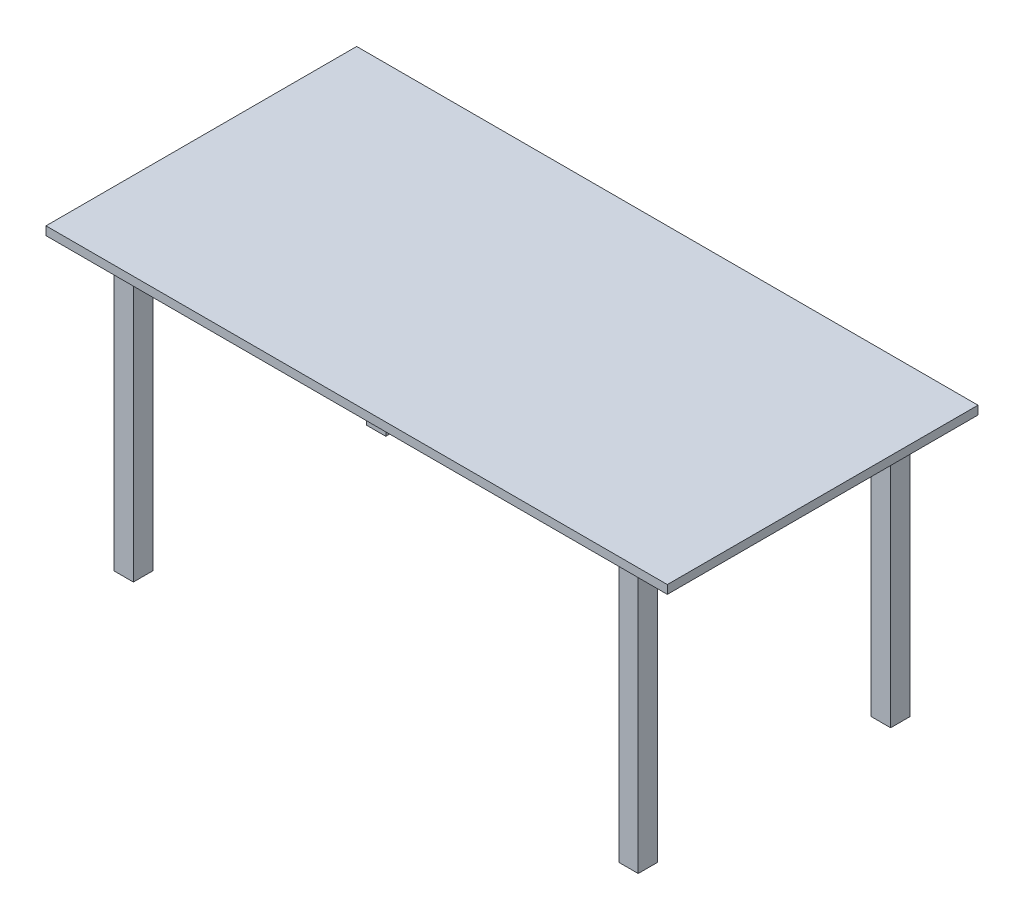
ISO-10303-21;
HEADER;
FILE_DESCRIPTION(('STEP AP214'),'2;1');
FILE_NAME('part.step','',(''),(''),'','','');
FILE_SCHEMA(('AUTOMOTIVE_DESIGN { 1 0 10303 214 1 1 1 1 }'));
ENDSEC;
DATA;
#1=APPLICATION_CONTEXT('core data for automotive mechanical design processes');
#2=APPLICATION_PROTOCOL_DEFINITION('international standard','automotive_design',2000,#1);
#3=PRODUCT_CONTEXT('',#1,'mechanical');
#4=PRODUCT('Part','Part','',(#3));
#5=PRODUCT_RELATED_PRODUCT_CATEGORY('part','',(#4));
#6=PRODUCT_DEFINITION_FORMATION('','',#4);
#7=PRODUCT_DEFINITION_CONTEXT('part definition',#1,'design');
#8=PRODUCT_DEFINITION('design','',#6,#7);
#9=PRODUCT_DEFINITION_SHAPE('','',#8);
#10=(LENGTH_UNIT() NAMED_UNIT(*) SI_UNIT(.MILLI.,.METRE.));
#11=(NAMED_UNIT(*) PLANE_ANGLE_UNIT() SI_UNIT($,.RADIAN.));
#12=(NAMED_UNIT(*) SI_UNIT($,.STERADIAN.) SOLID_ANGLE_UNIT());
#13=UNCERTAINTY_MEASURE_WITH_UNIT(LENGTH_MEASURE(1.E-05),#10,'distance_accuracy_value','');
#14=(GEOMETRIC_REPRESENTATION_CONTEXT(3) GLOBAL_UNCERTAINTY_ASSIGNED_CONTEXT((#13)) GLOBAL_UNIT_ASSIGNED_CONTEXT((#10,
#11,#12)) REPRESENTATION_CONTEXT('',''));
#15=CARTESIAN_POINT('',(0.,0.,0.));
#16=DIRECTION('',(0.,0.,1.));
#17=DIRECTION('',(1.,0.,0.));
#18=AXIS2_PLACEMENT_3D('',#15,#16,#17);
#19=CARTESIAN_POINT('',(0.,0.,0.));
#20=DIRECTION('',(0.,1.,0.));
#21=DIRECTION('',(0.,0.,1.));
#22=AXIS2_PLACEMENT_3D('',#19,#20,#21);
#23=PLANE('',#22);
#24=DIRECTION('',(1.,0.,0.));
#25=VECTOR('',#24,1.);
#26=CARTESIAN_POINT('',(-675.,0.,-350.));
#27=LINE('',#26,#25);
#28=CARTESIAN_POINT('',(-675.,0.,-350.));
#29=VERTEX_POINT('',#28);
#30=CARTESIAN_POINT('',(-625.,0.,-350.));
#31=VERTEX_POINT('',#30);
#32=EDGE_CURVE('E192',#29,#31,#27,.T.);
#33=ORIENTED_EDGE('',*,*,#32,.F.);
#34=DIRECTION('',(0.,0.,-1.));
#35=VECTOR('',#34,1.);
#36=CARTESIAN_POINT('',(-675.,0.,-350.));
#37=LINE('',#36,#35);
#38=CARTESIAN_POINT('',(-675.,0.,-300.));
#39=VERTEX_POINT('',#38);
#40=EDGE_CURVE('E205',#39,#29,#37,.T.);
#41=ORIENTED_EDGE('',*,*,#40,.F.);
#42=DIRECTION('',(-1.,0.,0.));
#43=VECTOR('',#42,1.);
#44=CARTESIAN_POINT('',(-675.,0.,-300.));
#45=LINE('',#44,#43);
#46=CARTESIAN_POINT('',(-625.,0.,-300.));
#47=VERTEX_POINT('',#46);
#48=EDGE_CURVE('E214',#47,#39,#45,.T.);
#49=ORIENTED_EDGE('',*,*,#48,.F.);
#50=DIRECTION('',(0.,0.,1.));
#51=VECTOR('',#50,1.);
#52=CARTESIAN_POINT('',(-625.,0.,-350.));
#53=LINE('',#52,#51);
#54=EDGE_CURVE('E195',#31,#47,#53,.T.);
#55=ORIENTED_EDGE('',*,*,#54,.F.);
#56=EDGE_LOOP('',(#33,#41,#49,#55));
#57=FACE_BOUND('',#56,.T.);
#58=DIRECTION('',(0.,0.,1.));
#59=VECTOR('',#58,1.);
#60=CARTESIAN_POINT('',(-625.,0.,350.));
#61=LINE('',#60,#59);
#62=CARTESIAN_POINT('',(-625.,0.,300.));
#63=VERTEX_POINT('',#62);
#64=CARTESIAN_POINT('',(-625.,0.,350.));
#65=VERTEX_POINT('',#64);
#66=EDGE_CURVE('E263',#63,#65,#61,.T.);
#67=ORIENTED_EDGE('',*,*,#66,.F.);
#68=DIRECTION('',(1.,0.,0.));
#69=VECTOR('',#68,1.);
#70=CARTESIAN_POINT('',(-675.,0.,300.));
#71=LINE('',#70,#69);
#72=CARTESIAN_POINT('',(-675.,0.,300.));
#73=VERTEX_POINT('',#72);
#74=EDGE_CURVE('E268',#73,#63,#71,.T.);
#75=ORIENTED_EDGE('',*,*,#74,.F.);
#76=DIRECTION('',(0.,0.,-1.));
#77=VECTOR('',#76,1.);
#78=CARTESIAN_POINT('',(-675.,0.,350.));
#79=LINE('',#78,#77);
#80=CARTESIAN_POINT('',(-675.,0.,350.));
#81=VERTEX_POINT('',#80);
#82=EDGE_CURVE('E280',#81,#73,#79,.T.);
#83=ORIENTED_EDGE('',*,*,#82,.F.);
#84=DIRECTION('',(-1.,0.,0.));
#85=VECTOR('',#84,1.);
#86=CARTESIAN_POINT('',(-675.,0.,350.));
#87=LINE('',#86,#85);
#88=EDGE_CURVE('E277',#65,#81,#87,.T.);
#89=ORIENTED_EDGE('',*,*,#88,.F.);
#90=EDGE_LOOP('',(#67,#75,#83,#89));
#91=FACE_BOUND('',#90,.T.);
#92=DIRECTION('',(0.,0.,-1.));
#93=VECTOR('',#92,1.);
#94=CARTESIAN_POINT('',(800.,0.,-400.));
#95=LINE('',#94,#93);
#96=CARTESIAN_POINT('',(800.,0.,400.));
#97=VERTEX_POINT('',#96);
#98=CARTESIAN_POINT('',(800.,0.,-400.));
#99=VERTEX_POINT('',#98);
#100=EDGE_CURVE('E296',#97,#99,#95,.T.);
#101=ORIENTED_EDGE('',*,*,#100,.F.);
#102=DIRECTION('',(1.,0.,0.));
#103=VECTOR('',#102,1.);
#104=CARTESIAN_POINT('',(-800.,0.,400.));
#105=LINE('',#104,#103);
#106=CARTESIAN_POINT('',(-800.,0.,400.));
#107=VERTEX_POINT('',#106);
#108=EDGE_CURVE('E301',#107,#97,#105,.T.);
#109=ORIENTED_EDGE('',*,*,#108,.F.);
#110=DIRECTION('',(0.,0.,1.));
#111=VECTOR('',#110,1.);
#112=CARTESIAN_POINT('',(-800.,0.,-400.));
#113=LINE('',#112,#111);
#114=CARTESIAN_POINT('',(-800.,0.,-400.));
#115=VERTEX_POINT('',#114);
#116=EDGE_CURVE('E312',#115,#107,#113,.T.);
#117=ORIENTED_EDGE('',*,*,#116,.F.);
#118=DIRECTION('',(-1.,0.,0.));
#119=VECTOR('',#118,1.);
#120=CARTESIAN_POINT('',(-800.,0.,-400.));
#121=LINE('',#120,#119);
#122=EDGE_CURVE('E310',#99,#115,#121,.T.);
#123=ORIENTED_EDGE('',*,*,#122,.F.);
#124=EDGE_LOOP('',(#101,#109,#117,#123));
#125=FACE_BOUND('',#124,.T.);
#126=DIRECTION('',(0.,0.,1.));
#127=VECTOR('',#126,1.);
#128=CARTESIAN_POINT('',(675.,0.,350.));
#129=LINE('',#128,#127);
#130=CARTESIAN_POINT('',(675.,0.,300.));
#131=VERTEX_POINT('',#130);
#132=CARTESIAN_POINT('',(675.,0.,350.));
#133=VERTEX_POINT('',#132);
#134=EDGE_CURVE('E230',#131,#133,#129,.T.);
#135=ORIENTED_EDGE('',*,*,#134,.F.);
#136=DIRECTION('',(1.,0.,0.));
#137=VECTOR('',#136,1.);
#138=CARTESIAN_POINT('',(675.,0.,300.));
#139=LINE('',#138,#137);
#140=CARTESIAN_POINT('',(625.,0.,300.));
#141=VERTEX_POINT('',#140);
#142=EDGE_CURVE('E235',#141,#131,#139,.T.);
#143=ORIENTED_EDGE('',*,*,#142,.F.);
#144=DIRECTION('',(0.,0.,-1.));
#145=VECTOR('',#144,1.);
#146=CARTESIAN_POINT('',(625.,0.,350.));
#147=LINE('',#146,#145);
#148=CARTESIAN_POINT('',(625.,0.,350.));
#149=VERTEX_POINT('',#148);
#150=EDGE_CURVE('E247',#149,#141,#147,.T.);
#151=ORIENTED_EDGE('',*,*,#150,.F.);
#152=DIRECTION('',(-1.,0.,0.));
#153=VECTOR('',#152,1.);
#154=CARTESIAN_POINT('',(675.,0.,350.));
#155=LINE('',#154,#153);
#156=EDGE_CURVE('E244',#133,#149,#155,.T.);
#157=ORIENTED_EDGE('',*,*,#156,.F.);
#158=EDGE_LOOP('',(#135,#143,#151,#157));
#159=FACE_BOUND('',#158,.T.);
#160=DIRECTION('',(1.,0.,0.));
#161=VECTOR('',#160,1.);
#162=CARTESIAN_POINT('',(675.,0.,-350.));
#163=LINE('',#162,#161);
#164=CARTESIAN_POINT('',(625.,0.,-350.));
#165=VERTEX_POINT('',#164);
#166=CARTESIAN_POINT('',(675.,0.,-350.));
#167=VERTEX_POINT('',#166);
#168=EDGE_CURVE('E191',#165,#167,#163,.T.);
#169=ORIENTED_EDGE('',*,*,#168,.F.);
#170=DIRECTION('',(0.,0.,-1.));
#171=VECTOR('',#170,1.);
#172=CARTESIAN_POINT('',(625.,0.,-350.));
#173=LINE('',#172,#171);
#174=CARTESIAN_POINT('',(625.,0.,-300.));
#175=VERTEX_POINT('',#174);
#176=EDGE_CURVE('E188',#175,#165,#173,.T.);
#177=ORIENTED_EDGE('',*,*,#176,.F.);
#178=DIRECTION('',(-1.,0.,0.));
#179=VECTOR('',#178,1.);
#180=CARTESIAN_POINT('',(675.,0.,-300.));
#181=LINE('',#180,#179);
#182=CARTESIAN_POINT('',(675.,0.,-300.));
#183=VERTEX_POINT('',#182);
#184=EDGE_CURVE('E54',#183,#175,#181,.T.);
#185=ORIENTED_EDGE('',*,*,#184,.F.);
#186=DIRECTION('',(0.,0.,1.));
#187=VECTOR('',#186,1.);
#188=CARTESIAN_POINT('',(675.,0.,-350.));
#189=LINE('',#188,#187);
#190=EDGE_CURVE('E49',#167,#183,#189,.T.);
#191=ORIENTED_EDGE('',*,*,#190,.F.);
#192=EDGE_LOOP('',(#169,#177,#185,#191));
#193=FACE_BOUND('',#192,.T.);
#194=ADVANCED_FACE('F34',(#57,#91,#125,#159,#193),#23,.F.);
#195=CARTESIAN_POINT('',(800.,22.,-400.));
#196=DIRECTION('',(-1.,0.,0.));
#197=DIRECTION('',(0.,0.,1.));
#198=AXIS2_PLACEMENT_3D('',#195,#196,#197);
#199=PLANE('',#198);
#200=ORIENTED_EDGE('',*,*,#100,.T.);
#201=DIRECTION('',(0.,-1.,0.));
#202=VECTOR('',#201,1.);
#203=CARTESIAN_POINT('',(800.,22.,-400.));
#204=LINE('',#203,#202);
#205=CARTESIAN_POINT('',(800.,22.,-400.));
#206=VERTEX_POINT('',#205);
#207=EDGE_CURVE('E11',#206,#99,#204,.T.);
#208=ORIENTED_EDGE('',*,*,#207,.F.);
#209=DIRECTION('',(0.,0.,-1.));
#210=VECTOR('',#209,1.);
#211=CARTESIAN_POINT('',(800.,22.,-400.));
#212=LINE('',#211,#210);
#213=CARTESIAN_POINT('',(800.,22.,400.));
#214=VERTEX_POINT('',#213);
#215=EDGE_CURVE('E297',#214,#206,#212,.T.);
#216=ORIENTED_EDGE('',*,*,#215,.F.);
#217=DIRECTION('',(0.,-1.,0.));
#218=VECTOR('',#217,1.);
#219=CARTESIAN_POINT('',(800.,22.,400.));
#220=LINE('',#219,#218);
#221=EDGE_CURVE('E307',#214,#97,#220,.T.);
#222=ORIENTED_EDGE('',*,*,#221,.T.);
#223=EDGE_LOOP('',(#200,#208,#216,#222));
#224=FACE_BOUND('',#223,.T.);
#225=ADVANCED_FACE('F36',(#224),#199,.F.);
#226=CARTESIAN_POINT('',(-800.,22.,-400.));
#227=DIRECTION('',(0.,0.,1.));
#228=DIRECTION('',(1.,0.,0.));
#229=AXIS2_PLACEMENT_3D('',#226,#227,#228);
#230=PLANE('',#229);
#231=ORIENTED_EDGE('',*,*,#122,.T.);
#232=DIRECTION('',(0.,-1.,0.));
#233=VECTOR('',#232,1.);
#234=CARTESIAN_POINT('',(-800.,22.,-400.));
#235=LINE('',#234,#233);
#236=CARTESIAN_POINT('',(-800.,22.,-400.));
#237=VERTEX_POINT('',#236);
#238=EDGE_CURVE('E42',#237,#115,#235,.T.);
#239=ORIENTED_EDGE('',*,*,#238,.F.);
#240=DIRECTION('',(-1.,0.,0.));
#241=VECTOR('',#240,1.);
#242=CARTESIAN_POINT('',(-800.,22.,-400.));
#243=LINE('',#242,#241);
#244=EDGE_CURVE('E300',#206,#237,#243,.T.);
#245=ORIENTED_EDGE('',*,*,#244,.F.);
#246=ORIENTED_EDGE('',*,*,#207,.T.);
#247=EDGE_LOOP('',(#231,#239,#245,#246));
#248=FACE_BOUND('',#247,.T.);
#249=ADVANCED_FACE('F340',(#248),#230,.F.);
#250=CARTESIAN_POINT('',(-800.,22.,-400.));
#251=DIRECTION('',(1.,0.,0.));
#252=DIRECTION('',(0.,0.,-1.));
#253=AXIS2_PLACEMENT_3D('',#250,#251,#252);
#254=PLANE('',#253);
#255=ORIENTED_EDGE('',*,*,#116,.T.);
#256=DIRECTION('',(0.,-1.,0.));
#257=VECTOR('',#256,1.);
#258=CARTESIAN_POINT('',(-800.,22.,400.));
#259=LINE('',#258,#257);
#260=CARTESIAN_POINT('',(-800.,22.,400.));
#261=VERTEX_POINT('',#260);
#262=EDGE_CURVE('E317',#261,#107,#259,.T.);
#263=ORIENTED_EDGE('',*,*,#262,.F.);
#264=DIRECTION('',(0.,0.,1.));
#265=VECTOR('',#264,1.);
#266=CARTESIAN_POINT('',(-800.,22.,-400.));
#267=LINE('',#266,#265);
#268=EDGE_CURVE('E303',#237,#261,#267,.T.);
#269=ORIENTED_EDGE('',*,*,#268,.F.);
#270=ORIENTED_EDGE('',*,*,#238,.T.);
#271=EDGE_LOOP('',(#255,#263,#269,#270));
#272=FACE_BOUND('',#271,.T.);
#273=ADVANCED_FACE('F324',(#272),#254,.F.);
#274=CARTESIAN_POINT('',(-800.,22.,400.));
#275=DIRECTION('',(0.,0.,-1.));
#276=DIRECTION('',(-1.,0.,0.));
#277=AXIS2_PLACEMENT_3D('',#274,#275,#276);
#278=PLANE('',#277);
#279=ORIENTED_EDGE('',*,*,#108,.T.);
#280=ORIENTED_EDGE('',*,*,#221,.F.);
#281=DIRECTION('',(1.,0.,0.));
#282=VECTOR('',#281,1.);
#283=CARTESIAN_POINT('',(-800.,22.,400.));
#284=LINE('',#283,#282);
#285=EDGE_CURVE('E305',#261,#214,#284,.T.);
#286=ORIENTED_EDGE('',*,*,#285,.F.);
#287=ORIENTED_EDGE('',*,*,#262,.T.);
#288=EDGE_LOOP('',(#279,#280,#286,#287));
#289=FACE_BOUND('',#288,.T.);
#290=ADVANCED_FACE('F333',(#289),#278,.F.);
#291=CARTESIAN_POINT('',(0.,22.,0.));
#292=DIRECTION('',(0.,1.,0.));
#293=DIRECTION('',(0.,0.,1.));
#294=AXIS2_PLACEMENT_3D('',#291,#292,#293);
#295=PLANE('',#294);
#296=ORIENTED_EDGE('',*,*,#215,.T.);
#297=ORIENTED_EDGE('',*,*,#244,.T.);
#298=ORIENTED_EDGE('',*,*,#268,.T.);
#299=ORIENTED_EDGE('',*,*,#285,.T.);
#300=EDGE_LOOP('',(#296,#297,#298,#299));
#301=FACE_BOUND('',#300,.T.);
#302=ADVANCED_FACE('F339',(#301),#295,.T.);
#303=CARTESIAN_POINT('',(-625.,-710.,350.));
#304=DIRECTION('',(-1.,0.,0.));
#305=DIRECTION('',(0.,0.,1.));
#306=AXIS2_PLACEMENT_3D('',#303,#304,#305);
#307=PLANE('',#306);
#308=ORIENTED_EDGE('',*,*,#66,.T.);
#309=DIRECTION('',(0.,1.,0.));
#310=VECTOR('',#309,1.);
#311=CARTESIAN_POINT('',(-625.,-710.,350.));
#312=LINE('',#311,#310);
#313=CARTESIAN_POINT('',(-625.,-710.,350.));
#314=VERTEX_POINT('',#313);
#315=EDGE_CURVE('E293',#314,#65,#312,.T.);
#316=ORIENTED_EDGE('',*,*,#315,.F.);
#317=DIRECTION('',(0.,0.,1.));
#318=VECTOR('',#317,1.);
#319=CARTESIAN_POINT('',(-625.,-710.,350.));
#320=LINE('',#319,#318);
#321=CARTESIAN_POINT('',(-625.,-710.,300.));
#322=VERTEX_POINT('',#321);
#323=EDGE_CURVE('E264',#322,#314,#320,.T.);
#324=ORIENTED_EDGE('',*,*,#323,.F.);
#325=DIRECTION('',(0.,1.,0.));
#326=VECTOR('',#325,1.);
#327=CARTESIAN_POINT('',(-625.,-710.,300.));
#328=LINE('',#327,#326);
#329=EDGE_CURVE('E274',#322,#63,#328,.T.);
#330=ORIENTED_EDGE('',*,*,#329,.T.);
#331=EDGE_LOOP('',(#308,#316,#324,#330));
#332=FACE_BOUND('',#331,.T.);
#333=ADVANCED_FACE('F360',(#332),#307,.F.);
#334=CARTESIAN_POINT('',(-675.,-710.,350.));
#335=DIRECTION('',(0.,0.,-1.));
#336=DIRECTION('',(-1.,0.,0.));
#337=AXIS2_PLACEMENT_3D('',#334,#335,#336);
#338=PLANE('',#337);
#339=ORIENTED_EDGE('',*,*,#88,.T.);
#340=DIRECTION('',(0.,1.,0.));
#341=VECTOR('',#340,1.);
#342=CARTESIAN_POINT('',(-675.,-710.,350.));
#343=LINE('',#342,#341);
#344=CARTESIAN_POINT('',(-675.,-710.,350.));
#345=VERTEX_POINT('',#344);
#346=EDGE_CURVE('E290',#345,#81,#343,.T.);
#347=ORIENTED_EDGE('',*,*,#346,.F.);
#348=DIRECTION('',(-1.,0.,0.));
#349=VECTOR('',#348,1.);
#350=CARTESIAN_POINT('',(-675.,-710.,350.));
#351=LINE('',#350,#349);
#352=EDGE_CURVE('E267',#314,#345,#351,.T.);
#353=ORIENTED_EDGE('',*,*,#352,.F.);
#354=ORIENTED_EDGE('',*,*,#315,.T.);
#355=EDGE_LOOP('',(#339,#347,#353,#354));
#356=FACE_BOUND('',#355,.T.);
#357=ADVANCED_FACE('F364',(#356),#338,.F.);
#358=CARTESIAN_POINT('',(-675.,-710.,350.));
#359=DIRECTION('',(1.,0.,0.));
#360=DIRECTION('',(0.,0.,-1.));
#361=AXIS2_PLACEMENT_3D('',#358,#359,#360);
#362=PLANE('',#361);
#363=ORIENTED_EDGE('',*,*,#82,.T.);
#364=DIRECTION('',(0.,1.,0.));
#365=VECTOR('',#364,1.);
#366=CARTESIAN_POINT('',(-675.,-710.,300.));
#367=LINE('',#366,#365);
#368=CARTESIAN_POINT('',(-675.,-710.,300.));
#369=VERTEX_POINT('',#368);
#370=EDGE_CURVE('E287',#369,#73,#367,.T.);
#371=ORIENTED_EDGE('',*,*,#370,.F.);
#372=DIRECTION('',(0.,0.,-1.));
#373=VECTOR('',#372,1.);
#374=CARTESIAN_POINT('',(-675.,-710.,350.));
#375=LINE('',#374,#373);
#376=EDGE_CURVE('E270',#345,#369,#375,.T.);
#377=ORIENTED_EDGE('',*,*,#376,.F.);
#378=ORIENTED_EDGE('',*,*,#346,.T.);
#379=EDGE_LOOP('',(#363,#371,#377,#378));
#380=FACE_BOUND('',#379,.T.);
#381=ADVANCED_FACE('F369',(#380),#362,.F.);
#382=CARTESIAN_POINT('',(-675.,-710.,300.));
#383=DIRECTION('',(0.,0.,1.));
#384=DIRECTION('',(1.,0.,0.));
#385=AXIS2_PLACEMENT_3D('',#382,#383,#384);
#386=PLANE('',#385);
#387=ORIENTED_EDGE('',*,*,#74,.T.);
#388=ORIENTED_EDGE('',*,*,#329,.F.);
#389=DIRECTION('',(1.,0.,0.));
#390=VECTOR('',#389,1.);
#391=CARTESIAN_POINT('',(-675.,-710.,300.));
#392=LINE('',#391,#390);
#393=EDGE_CURVE('E272',#369,#322,#392,.T.);
#394=ORIENTED_EDGE('',*,*,#393,.F.);
#395=ORIENTED_EDGE('',*,*,#370,.T.);
#396=EDGE_LOOP('',(#387,#388,#394,#395));
#397=FACE_BOUND('',#396,.T.);
#398=ADVANCED_FACE('F375',(#397),#386,.F.);
#399=CARTESIAN_POINT('',(0.,-710.,0.));
#400=DIRECTION('',(0.,-1.,0.));
#401=DIRECTION('',(0.,0.,-1.));
#402=AXIS2_PLACEMENT_3D('',#399,#400,#401);
#403=PLANE('',#402);
#404=ORIENTED_EDGE('',*,*,#323,.T.);
#405=ORIENTED_EDGE('',*,*,#352,.T.);
#406=ORIENTED_EDGE('',*,*,#376,.T.);
#407=ORIENTED_EDGE('',*,*,#393,.T.);
#408=EDGE_LOOP('',(#404,#405,#406,#407));
#409=FACE_BOUND('',#408,.T.);
#410=ADVANCED_FACE('F379',(#409),#403,.T.);
#411=CARTESIAN_POINT('',(675.,-710.,350.));
#412=DIRECTION('',(-1.,0.,0.));
#413=DIRECTION('',(0.,0.,1.));
#414=AXIS2_PLACEMENT_3D('',#411,#412,#413);
#415=PLANE('',#414);
#416=ORIENTED_EDGE('',*,*,#134,.T.);
#417=DIRECTION('',(0.,1.,0.));
#418=VECTOR('',#417,1.);
#419=CARTESIAN_POINT('',(675.,-710.,350.));
#420=LINE('',#419,#418);
#421=CARTESIAN_POINT('',(675.,-710.,350.));
#422=VERTEX_POINT('',#421);
#423=EDGE_CURVE('E260',#422,#133,#420,.T.);
#424=ORIENTED_EDGE('',*,*,#423,.F.);
#425=DIRECTION('',(0.,0.,1.));
#426=VECTOR('',#425,1.);
#427=CARTESIAN_POINT('',(675.,-710.,350.));
#428=LINE('',#427,#426);
#429=CARTESIAN_POINT('',(675.,-710.,300.));
#430=VERTEX_POINT('',#429);
#431=EDGE_CURVE('E231',#430,#422,#428,.T.);
#432=ORIENTED_EDGE('',*,*,#431,.F.);
#433=DIRECTION('',(0.,1.,0.));
#434=VECTOR('',#433,1.);
#435=CARTESIAN_POINT('',(675.,-710.,300.));
#436=LINE('',#435,#434);
#437=EDGE_CURVE('E241',#430,#131,#436,.T.);
#438=ORIENTED_EDGE('',*,*,#437,.T.);
#439=EDGE_LOOP('',(#416,#424,#432,#438));
#440=FACE_BOUND('',#439,.T.);
#441=ADVANCED_FACE('F383',(#440),#415,.F.);
#442=CARTESIAN_POINT('',(675.,-710.,350.));
#443=DIRECTION('',(0.,0.,-1.));
#444=DIRECTION('',(-1.,0.,0.));
#445=AXIS2_PLACEMENT_3D('',#442,#443,#444);
#446=PLANE('',#445);
#447=ORIENTED_EDGE('',*,*,#156,.T.);
#448=DIRECTION('',(0.,1.,0.));
#449=VECTOR('',#448,1.);
#450=CARTESIAN_POINT('',(625.,-710.,350.));
#451=LINE('',#450,#449);
#452=CARTESIAN_POINT('',(625.,-710.,350.));
#453=VERTEX_POINT('',#452);
#454=EDGE_CURVE('E257',#453,#149,#451,.T.);
#455=ORIENTED_EDGE('',*,*,#454,.F.);
#456=DIRECTION('',(-1.,0.,0.));
#457=VECTOR('',#456,1.);
#458=CARTESIAN_POINT('',(675.,-710.,350.));
#459=LINE('',#458,#457);
#460=EDGE_CURVE('E234',#422,#453,#459,.T.);
#461=ORIENTED_EDGE('',*,*,#460,.F.);
#462=ORIENTED_EDGE('',*,*,#423,.T.);
#463=EDGE_LOOP('',(#447,#455,#461,#462));
#464=FACE_BOUND('',#463,.T.);
#465=ADVANCED_FACE('F387',(#464),#446,.F.);
#466=CARTESIAN_POINT('',(625.,-710.,350.));
#467=DIRECTION('',(1.,0.,0.));
#468=DIRECTION('',(0.,0.,-1.));
#469=AXIS2_PLACEMENT_3D('',#466,#467,#468);
#470=PLANE('',#469);
#471=ORIENTED_EDGE('',*,*,#150,.T.);
#472=DIRECTION('',(0.,1.,0.));
#473=VECTOR('',#472,1.);
#474=CARTESIAN_POINT('',(625.,-710.,300.));
#475=LINE('',#474,#473);
#476=CARTESIAN_POINT('',(625.,-710.,300.));
#477=VERTEX_POINT('',#476);
#478=EDGE_CURVE('E254',#477,#141,#475,.T.);
#479=ORIENTED_EDGE('',*,*,#478,.F.);
#480=DIRECTION('',(0.,0.,-1.));
#481=VECTOR('',#480,1.);
#482=CARTESIAN_POINT('',(625.,-710.,350.));
#483=LINE('',#482,#481);
#484=EDGE_CURVE('E237',#453,#477,#483,.T.);
#485=ORIENTED_EDGE('',*,*,#484,.F.);
#486=ORIENTED_EDGE('',*,*,#454,.T.);
#487=EDGE_LOOP('',(#471,#479,#485,#486));
#488=FACE_BOUND('',#487,.T.);
#489=ADVANCED_FACE('F391',(#488),#470,.F.);
#490=CARTESIAN_POINT('',(675.,-710.,300.));
#491=DIRECTION('',(0.,0.,1.));
#492=DIRECTION('',(1.,0.,0.));
#493=AXIS2_PLACEMENT_3D('',#490,#491,#492);
#494=PLANE('',#493);
#495=ORIENTED_EDGE('',*,*,#142,.T.);
#496=ORIENTED_EDGE('',*,*,#437,.F.);
#497=DIRECTION('',(1.,0.,0.));
#498=VECTOR('',#497,1.);
#499=CARTESIAN_POINT('',(675.,-710.,300.));
#500=LINE('',#499,#498);
#501=EDGE_CURVE('E239',#477,#430,#500,.T.);
#502=ORIENTED_EDGE('',*,*,#501,.F.);
#503=ORIENTED_EDGE('',*,*,#478,.T.);
#504=EDGE_LOOP('',(#495,#496,#502,#503));
#505=FACE_BOUND('',#504,.T.);
#506=ADVANCED_FACE('F395',(#505),#494,.F.);
#507=CARTESIAN_POINT('',(0.,-710.,0.));
#508=DIRECTION('',(0.,1.,0.));
#509=DIRECTION('',(0.,0.,1.));
#510=AXIS2_PLACEMENT_3D('',#507,#508,#509);
#511=PLANE('',#510);
#512=ORIENTED_EDGE('',*,*,#431,.T.);
#513=ORIENTED_EDGE('',*,*,#460,.T.);
#514=ORIENTED_EDGE('',*,*,#484,.T.);
#515=ORIENTED_EDGE('',*,*,#501,.T.);
#516=EDGE_LOOP('',(#512,#513,#514,#515));
#517=FACE_BOUND('',#516,.T.);
#518=ADVANCED_FACE('F399',(#517),#511,.F.);
#519=CARTESIAN_POINT('',(-675.,-710.,-350.));
#520=DIRECTION('',(0.,0.,1.));
#521=DIRECTION('',(1.,0.,0.));
#522=AXIS2_PLACEMENT_3D('',#519,#520,#521);
#523=PLANE('',#522);
#524=ORIENTED_EDGE('',*,*,#32,.T.);
#525=DIRECTION('',(0.,1.,0.));
#526=VECTOR('',#525,1.);
#527=CARTESIAN_POINT('',(-625.,-710.,-350.));
#528=LINE('',#527,#526);
#529=CARTESIAN_POINT('',(-625.,-710.,-350.));
#530=VERTEX_POINT('',#529);
#531=EDGE_CURVE('E227',#530,#31,#528,.T.);
#532=ORIENTED_EDGE('',*,*,#531,.F.);
#533=DIRECTION('',(1.,0.,0.));
#534=VECTOR('',#533,1.);
#535=CARTESIAN_POINT('',(-675.,-710.,-350.));
#536=LINE('',#535,#534);
#537=CARTESIAN_POINT('',(-675.,-710.,-350.));
#538=VERTEX_POINT('',#537);
#539=EDGE_CURVE('E201',#538,#530,#536,.T.);
#540=ORIENTED_EDGE('',*,*,#539,.F.);
#541=DIRECTION('',(0.,1.,0.));
#542=VECTOR('',#541,1.);
#543=CARTESIAN_POINT('',(-675.,-710.,-350.));
#544=LINE('',#543,#542);
#545=EDGE_CURVE('E210',#538,#29,#544,.T.);
#546=ORIENTED_EDGE('',*,*,#545,.T.);
#547=EDGE_LOOP('',(#524,#532,#540,#546));
#548=FACE_BOUND('',#547,.T.);
#549=ADVANCED_FACE('F403',(#548),#523,.F.);
#550=CARTESIAN_POINT('',(-625.,-710.,-350.));
#551=DIRECTION('',(-1.,0.,0.));
#552=DIRECTION('',(0.,0.,1.));
#553=AXIS2_PLACEMENT_3D('',#550,#551,#552);
#554=PLANE('',#553);
#555=ORIENTED_EDGE('',*,*,#54,.T.);
#556=DIRECTION('',(0.,1.,0.));
#557=VECTOR('',#556,1.);
#558=CARTESIAN_POINT('',(-625.,-710.,-300.));
#559=LINE('',#558,#557);
#560=CARTESIAN_POINT('',(-625.,-710.,-300.));
#561=VERTEX_POINT('',#560);
#562=EDGE_CURVE('E224',#561,#47,#559,.T.);
#563=ORIENTED_EDGE('',*,*,#562,.F.);
#564=DIRECTION('',(0.,0.,1.));
#565=VECTOR('',#564,1.);
#566=CARTESIAN_POINT('',(-625.,-710.,-350.));
#567=LINE('',#566,#565);
#568=EDGE_CURVE('E204',#530,#561,#567,.T.);
#569=ORIENTED_EDGE('',*,*,#568,.F.);
#570=ORIENTED_EDGE('',*,*,#531,.T.);
#571=EDGE_LOOP('',(#555,#563,#569,#570));
#572=FACE_BOUND('',#571,.T.);
#573=ADVANCED_FACE('F407',(#572),#554,.F.);
#574=CARTESIAN_POINT('',(-675.,-710.,-300.));
#575=DIRECTION('',(0.,0.,-1.));
#576=DIRECTION('',(-1.,0.,0.));
#577=AXIS2_PLACEMENT_3D('',#574,#575,#576);
#578=PLANE('',#577);
#579=ORIENTED_EDGE('',*,*,#48,.T.);
#580=DIRECTION('',(0.,1.,0.));
#581=VECTOR('',#580,1.);
#582=CARTESIAN_POINT('',(-675.,-710.,-300.));
#583=LINE('',#582,#581);
#584=CARTESIAN_POINT('',(-675.,-710.,-300.));
#585=VERTEX_POINT('',#584);
#586=EDGE_CURVE('E221',#585,#39,#583,.T.);
#587=ORIENTED_EDGE('',*,*,#586,.F.);
#588=DIRECTION('',(-1.,0.,0.));
#589=VECTOR('',#588,1.);
#590=CARTESIAN_POINT('',(-675.,-710.,-300.));
#591=LINE('',#590,#589);
#592=EDGE_CURVE('E207',#561,#585,#591,.T.);
#593=ORIENTED_EDGE('',*,*,#592,.F.);
#594=ORIENTED_EDGE('',*,*,#562,.T.);
#595=EDGE_LOOP('',(#579,#587,#593,#594));
#596=FACE_BOUND('',#595,.T.);
#597=ADVANCED_FACE('F411',(#596),#578,.F.);
#598=CARTESIAN_POINT('',(-675.,-710.,-350.));
#599=DIRECTION('',(1.,0.,0.));
#600=DIRECTION('',(0.,0.,-1.));
#601=AXIS2_PLACEMENT_3D('',#598,#599,#600);
#602=PLANE('',#601);
#603=ORIENTED_EDGE('',*,*,#40,.T.);
#604=ORIENTED_EDGE('',*,*,#545,.F.);
#605=DIRECTION('',(0.,0.,-1.));
#606=VECTOR('',#605,1.);
#607=CARTESIAN_POINT('',(-675.,-710.,-350.));
#608=LINE('',#607,#606);
#609=EDGE_CURVE('E209',#585,#538,#608,.T.);
#610=ORIENTED_EDGE('',*,*,#609,.F.);
#611=ORIENTED_EDGE('',*,*,#586,.T.);
#612=EDGE_LOOP('',(#603,#604,#610,#611));
#613=FACE_BOUND('',#612,.T.);
#614=ADVANCED_FACE('F415',(#613),#602,.F.);
#615=CARTESIAN_POINT('',(0.,-710.,0.));
#616=DIRECTION('',(0.,-1.,0.));
#617=DIRECTION('',(0.,0.,-1.));
#618=AXIS2_PLACEMENT_3D('',#615,#616,#617);
#619=PLANE('',#618);
#620=ORIENTED_EDGE('',*,*,#539,.T.);
#621=ORIENTED_EDGE('',*,*,#568,.T.);
#622=ORIENTED_EDGE('',*,*,#592,.T.);
#623=ORIENTED_EDGE('',*,*,#609,.T.);
#624=EDGE_LOOP('',(#620,#621,#622,#623));
#625=FACE_BOUND('',#624,.T.);
#626=ADVANCED_FACE('F419',(#625),#619,.T.);
#627=CARTESIAN_POINT('',(675.,-710.,-350.));
#628=DIRECTION('',(0.,0.,1.));
#629=DIRECTION('',(1.,0.,0.));
#630=AXIS2_PLACEMENT_3D('',#627,#628,#629);
#631=PLANE('',#630);
#632=ORIENTED_EDGE('',*,*,#168,.T.);
#633=DIRECTION('',(0.,1.,0.));
#634=VECTOR('',#633,1.);
#635=CARTESIAN_POINT('',(675.,-710.,-350.));
#636=LINE('',#635,#634);
#637=CARTESIAN_POINT('',(675.,-710.,-350.));
#638=VERTEX_POINT('',#637);
#639=EDGE_CURVE('E172',#638,#167,#636,.T.);
#640=ORIENTED_EDGE('',*,*,#639,.F.);
#641=DIRECTION('',(1.,0.,0.));
#642=VECTOR('',#641,1.);
#643=CARTESIAN_POINT('',(675.,-710.,-350.));
#644=LINE('',#643,#642);
#645=CARTESIAN_POINT('',(625.,-710.,-350.));
#646=VERTEX_POINT('',#645);
#647=EDGE_CURVE('E179',#646,#638,#644,.T.);
#648=ORIENTED_EDGE('',*,*,#647,.F.);
#649=DIRECTION('',(0.,1.,0.));
#650=VECTOR('',#649,1.);
#651=CARTESIAN_POINT('',(625.,-710.,-350.));
#652=LINE('',#651,#650);
#653=EDGE_CURVE('E585',#646,#165,#652,.T.);
#654=ORIENTED_EDGE('',*,*,#653,.T.);
#655=EDGE_LOOP('',(#632,#640,#648,#654));
#656=FACE_BOUND('',#655,.T.);
#657=ADVANCED_FACE('F190',(#656),#631,.F.);
#658=CARTESIAN_POINT('',(675.,-710.,-350.));
#659=DIRECTION('',(-1.,0.,0.));
#660=DIRECTION('',(0.,0.,1.));
#661=AXIS2_PLACEMENT_3D('',#658,#659,#660);
#662=PLANE('',#661);
#663=ORIENTED_EDGE('',*,*,#190,.T.);
#664=DIRECTION('',(0.,1.,0.));
#665=VECTOR('',#664,1.);
#666=CARTESIAN_POINT('',(675.,-710.,-300.));
#667=LINE('',#666,#665);
#668=CARTESIAN_POINT('',(675.,-710.,-300.));
#669=VERTEX_POINT('',#668);
#670=EDGE_CURVE('E175',#669,#183,#667,.T.);
#671=ORIENTED_EDGE('',*,*,#670,.F.);
#672=DIRECTION('',(0.,0.,1.));
#673=VECTOR('',#672,1.);
#674=CARTESIAN_POINT('',(675.,-710.,-350.));
#675=LINE('',#674,#673);
#676=EDGE_CURVE('E168',#638,#669,#675,.T.);
#677=ORIENTED_EDGE('',*,*,#676,.F.);
#678=ORIENTED_EDGE('',*,*,#639,.T.);
#679=EDGE_LOOP('',(#663,#671,#677,#678));
#680=FACE_BOUND('',#679,.T.);
#681=ADVANCED_FACE('F170',(#680),#662,.F.);
#682=CARTESIAN_POINT('',(675.,-710.,-300.));
#683=DIRECTION('',(0.,0.,-1.));
#684=DIRECTION('',(-1.,0.,0.));
#685=AXIS2_PLACEMENT_3D('',#682,#683,#684);
#686=PLANE('',#685);
#687=ORIENTED_EDGE('',*,*,#184,.T.);
#688=DIRECTION('',(0.,1.,0.));
#689=VECTOR('',#688,1.);
#690=CARTESIAN_POINT('',(625.,-710.,-300.));
#691=LINE('',#690,#689);
#692=CARTESIAN_POINT('',(625.,-710.,-300.));
#693=VERTEX_POINT('',#692);
#694=EDGE_CURVE('E197',#693,#175,#691,.T.);
#695=ORIENTED_EDGE('',*,*,#694,.F.);
#696=DIRECTION('',(-1.,0.,0.));
#697=VECTOR('',#696,1.);
#698=CARTESIAN_POINT('',(675.,-710.,-300.));
#699=LINE('',#698,#697);
#700=EDGE_CURVE('E178',#669,#693,#699,.T.);
#701=ORIENTED_EDGE('',*,*,#700,.F.);
#702=ORIENTED_EDGE('',*,*,#670,.T.);
#703=EDGE_LOOP('',(#687,#695,#701,#702));
#704=FACE_BOUND('',#703,.T.);
#705=ADVANCED_FACE('F428',(#704),#686,.F.);
#706=CARTESIAN_POINT('',(625.,-710.,-350.));
#707=DIRECTION('',(1.,0.,0.));
#708=DIRECTION('',(0.,0.,-1.));
#709=AXIS2_PLACEMENT_3D('',#706,#707,#708);
#710=PLANE('',#709);
#711=ORIENTED_EDGE('',*,*,#176,.T.);
#712=ORIENTED_EDGE('',*,*,#653,.F.);
#713=DIRECTION('',(0.,0.,-1.));
#714=VECTOR('',#713,1.);
#715=CARTESIAN_POINT('',(625.,-710.,-350.));
#716=LINE('',#715,#714);
#717=EDGE_CURVE('E184',#693,#646,#716,.T.);
#718=ORIENTED_EDGE('',*,*,#717,.F.);
#719=ORIENTED_EDGE('',*,*,#694,.T.);
#720=EDGE_LOOP('',(#711,#712,#718,#719));
#721=FACE_BOUND('',#720,.T.);
#722=ADVANCED_FACE('F431',(#721),#710,.F.);
#723=CARTESIAN_POINT('',(0.,-710.,0.));
#724=DIRECTION('',(0.,1.,0.));
#725=DIRECTION('',(0.,0.,1.));
#726=AXIS2_PLACEMENT_3D('',#723,#724,#725);
#727=PLANE('',#726);
#728=ORIENTED_EDGE('',*,*,#647,.T.);
#729=ORIENTED_EDGE('',*,*,#676,.T.);
#730=ORIENTED_EDGE('',*,*,#700,.T.);
#731=ORIENTED_EDGE('',*,*,#717,.T.);
#732=EDGE_LOOP('',(#728,#729,#730,#731));
#733=FACE_BOUND('',#732,.T.);
#734=ADVANCED_FACE('F182',(#733),#727,.F.);
#735=CLOSED_SHELL('',(#194,#225,#249,#273,#290,#302,#333,#357,#381,#398,#410,#441,#465,#489,
#506,#518,#549,#573,#597,#614,#626,#657,#681,#705,#722,#734));
#736=MANIFOLD_SOLID_BREP('B2',#735);
#737=ADVANCED_BREP_SHAPE_REPRESENTATION('',(#18,#736),#14);
#738=SHAPE_DEFINITION_REPRESENTATION(#9,#737);
ENDSEC;
END-ISO-10303-21;
